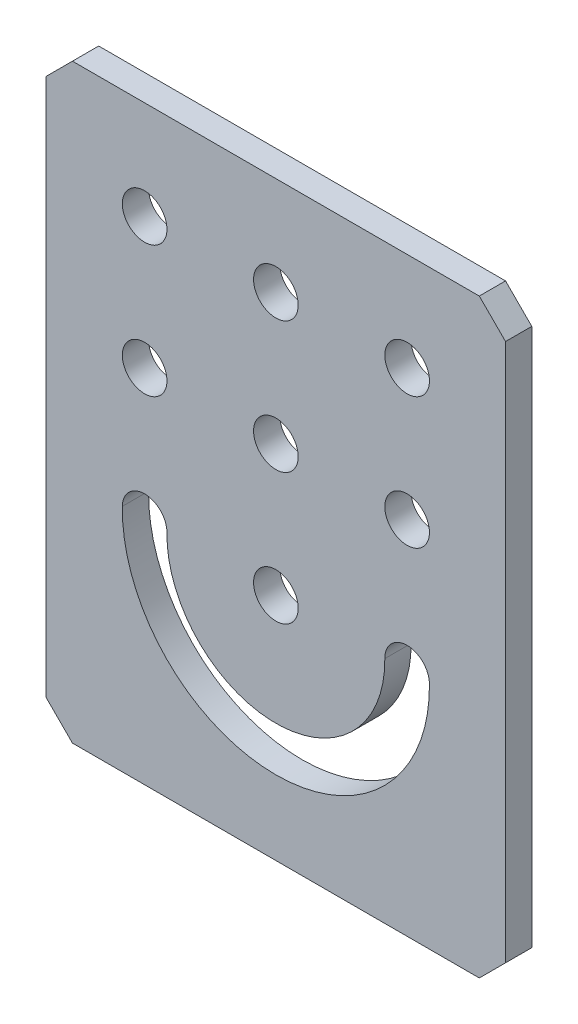
ISO-10303-21;
HEADER;
FILE_DESCRIPTION(('STEP AP214'),'2;1');
FILE_NAME('part.step','',(''),(''),'','','');
FILE_SCHEMA(('AUTOMOTIVE_DESIGN { 1 0 10303 214 1 1 1 1 }'));
ENDSEC;
DATA;
#1=APPLICATION_CONTEXT('core data for automotive mechanical design processes');
#2=APPLICATION_PROTOCOL_DEFINITION('international standard','automotive_design',2000,#1);
#3=PRODUCT_CONTEXT('',#1,'mechanical');
#4=PRODUCT('Part','Part','',(#3));
#5=PRODUCT_RELATED_PRODUCT_CATEGORY('part','',(#4));
#6=PRODUCT_DEFINITION_FORMATION('','',#4);
#7=PRODUCT_DEFINITION_CONTEXT('part definition',#1,'design');
#8=PRODUCT_DEFINITION('design','',#6,#7);
#9=PRODUCT_DEFINITION_SHAPE('','',#8);
#10=(LENGTH_UNIT() NAMED_UNIT(*) SI_UNIT(.MILLI.,.METRE.));
#11=(NAMED_UNIT(*) PLANE_ANGLE_UNIT() SI_UNIT($,.RADIAN.));
#12=(NAMED_UNIT(*) SI_UNIT($,.STERADIAN.) SOLID_ANGLE_UNIT());
#13=UNCERTAINTY_MEASURE_WITH_UNIT(LENGTH_MEASURE(1.E-05),#10,'distance_accuracy_value','');
#14=(GEOMETRIC_REPRESENTATION_CONTEXT(3) GLOBAL_UNCERTAINTY_ASSIGNED_CONTEXT((#13)) GLOBAL_UNIT_ASSIGNED_CONTEXT((#10,
#11,#12)) REPRESENTATION_CONTEXT('',''));
#15=CARTESIAN_POINT('',(0.,0.,0.));
#16=DIRECTION('',(0.,0.,1.));
#17=DIRECTION('',(1.,0.,0.));
#18=AXIS2_PLACEMENT_3D('',#15,#16,#17);
#19=CARTESIAN_POINT('',(0.,0.,2.));
#20=DIRECTION('',(0.,0.,1.));
#21=DIRECTION('',(1.,0.,0.));
#22=AXIS2_PLACEMENT_3D('',#19,#20,#21);
#23=PLANE('',#22);
#24=CARTESIAN_POINT('',(0.,-5.,2.));
#25=DIRECTION('',(0.,0.,1.));
#26=DIRECTION('',(1.,0.,0.));
#27=AXIS2_PLACEMENT_3D('',#24,#25,#26);
#28=CIRCLE('',#27,1.7);
#29=CARTESIAN_POINT('',(1.7,-5.,2.));
#30=VERTEX_POINT('',#29);
#31=EDGE_CURVE('E92',#30,#30,#28,.F.);
#32=ORIENTED_EDGE('',*,*,#31,.T.);
#33=EDGE_LOOP('',(#32));
#34=FACE_BOUND('',#33,.T.);
#35=CARTESIAN_POINT('',(9.99999999999999,5.,2.));
#36=DIRECTION('',(0.,0.,1.));
#37=DIRECTION('',(1.,0.,0.));
#38=AXIS2_PLACEMENT_3D('',#35,#36,#37);
#39=CIRCLE('',#38,1.7);
#40=CARTESIAN_POINT('',(11.7,5.,2.));
#41=VERTEX_POINT('',#40);
#42=EDGE_CURVE('E179',#41,#41,#39,.F.);
#43=ORIENTED_EDGE('',*,*,#42,.T.);
#44=EDGE_LOOP('',(#43));
#45=FACE_BOUND('',#44,.T.);
#46=CARTESIAN_POINT('',(0.,5.,2.));
#47=DIRECTION('',(0.,0.,1.));
#48=DIRECTION('',(1.,0.,0.));
#49=AXIS2_PLACEMENT_3D('',#46,#47,#48);
#50=CIRCLE('',#49,1.7);
#51=CARTESIAN_POINT('',(1.69999999999999,5.,2.));
#52=VERTEX_POINT('',#51);
#53=EDGE_CURVE('E182',#52,#52,#50,.F.);
#54=ORIENTED_EDGE('',*,*,#53,.T.);
#55=EDGE_LOOP('',(#54));
#56=FACE_BOUND('',#55,.T.);
#57=CARTESIAN_POINT('',(-10.,5.,2.));
#58=DIRECTION('',(0.,0.,1.));
#59=DIRECTION('',(1.,0.,0.));
#60=AXIS2_PLACEMENT_3D('',#57,#58,#59);
#61=CIRCLE('',#60,1.7);
#62=CARTESIAN_POINT('',(-8.30000000000001,5.,2.));
#63=VERTEX_POINT('',#62);
#64=EDGE_CURVE('E185',#63,#63,#61,.F.);
#65=ORIENTED_EDGE('',*,*,#64,.T.);
#66=EDGE_LOOP('',(#65));
#67=FACE_BOUND('',#66,.T.);
#68=CARTESIAN_POINT('',(9.99999999999999,15.,2.));
#69=DIRECTION('',(0.,0.,1.));
#70=DIRECTION('',(1.,0.,0.));
#71=AXIS2_PLACEMENT_3D('',#68,#69,#70);
#72=CIRCLE('',#71,1.7);
#73=CARTESIAN_POINT('',(11.7,15.,2.));
#74=VERTEX_POINT('',#73);
#75=EDGE_CURVE('E105',#74,#74,#72,.F.);
#76=ORIENTED_EDGE('',*,*,#75,.T.);
#77=EDGE_LOOP('',(#76));
#78=FACE_BOUND('',#77,.T.);
#79=DIRECTION('',(1.,0.,0.));
#80=VECTOR('',#79,1.);
#81=CARTESIAN_POINT('',(-17.5,22.5,2.));
#82=LINE('',#81,#80);
#83=CARTESIAN_POINT('',(15.5,22.5,2.));
#84=VERTEX_POINT('',#83);
#85=CARTESIAN_POINT('',(-15.5,22.5,2.));
#86=VERTEX_POINT('',#85);
#87=EDGE_CURVE('E130',#84,#86,#82,.F.);
#88=ORIENTED_EDGE('',*,*,#87,.T.);
#89=DIRECTION('',(0.707106781186549,0.707106781186546,0.));
#90=VECTOR('',#89,1.);
#91=CARTESIAN_POINT('',(-17.5,20.5,2.));
#92=LINE('',#91,#90);
#93=CARTESIAN_POINT('',(-17.5,20.5,2.));
#94=VERTEX_POINT('',#93);
#95=EDGE_CURVE('E124',#86,#94,#92,.F.);
#96=ORIENTED_EDGE('',*,*,#95,.T.);
#97=DIRECTION('',(0.,1.,0.));
#98=VECTOR('',#97,1.);
#99=CARTESIAN_POINT('',(-17.5,22.5,2.));
#100=LINE('',#99,#98);
#101=CARTESIAN_POINT('',(-17.5,-20.5,2.));
#102=VERTEX_POINT('',#101);
#103=EDGE_CURVE('E118',#94,#102,#100,.F.);
#104=ORIENTED_EDGE('',*,*,#103,.T.);
#105=DIRECTION('',(-0.707106781186546,0.707106781186549,0.));
#106=VECTOR('',#105,1.);
#107=CARTESIAN_POINT('',(-15.5,-22.5,2.));
#108=LINE('',#107,#106);
#109=CARTESIAN_POINT('',(-15.5,-22.5,2.));
#110=VERTEX_POINT('',#109);
#111=EDGE_CURVE('E112',#102,#110,#108,.F.);
#112=ORIENTED_EDGE('',*,*,#111,.T.);
#113=DIRECTION('',(1.,0.,0.));
#114=VECTOR('',#113,1.);
#115=CARTESIAN_POINT('',(-17.5,-22.5,2.));
#116=LINE('',#115,#114);
#117=CARTESIAN_POINT('',(15.5,-22.5,2.));
#118=VERTEX_POINT('',#117);
#119=EDGE_CURVE('E102',#110,#118,#116,.T.);
#120=ORIENTED_EDGE('',*,*,#119,.T.);
#121=DIRECTION('',(-0.707106781186549,-0.707106781186546,0.));
#122=VECTOR('',#121,1.);
#123=CARTESIAN_POINT('',(17.5,-20.5,2.));
#124=LINE('',#123,#122);
#125=CARTESIAN_POINT('',(17.5,-20.5,2.));
#126=VERTEX_POINT('',#125);
#127=EDGE_CURVE('E148',#118,#126,#124,.F.);
#128=ORIENTED_EDGE('',*,*,#127,.T.);
#129=DIRECTION('',(0.,-1.,0.));
#130=VECTOR('',#129,1.);
#131=CARTESIAN_POINT('',(17.5,22.5,2.));
#132=LINE('',#131,#130);
#133=CARTESIAN_POINT('',(17.5,20.5,2.));
#134=VERTEX_POINT('',#133);
#135=EDGE_CURVE('E142',#126,#134,#132,.F.);
#136=ORIENTED_EDGE('',*,*,#135,.T.);
#137=DIRECTION('',(0.707106781186546,-0.707106781186549,0.));
#138=VECTOR('',#137,1.);
#139=CARTESIAN_POINT('',(15.5,22.5,2.));
#140=LINE('',#139,#138);
#141=EDGE_CURVE('E136',#134,#84,#140,.F.);
#142=ORIENTED_EDGE('',*,*,#141,.T.);
#143=EDGE_LOOP('',(#88,#96,#104,#112,#120,#128,#136,#142));
#144=FACE_BOUND('',#143,.T.);
#145=CARTESIAN_POINT('',(-10.,15.,2.));
#146=DIRECTION('',(0.,0.,1.));
#147=DIRECTION('',(1.,0.,0.));
#148=AXIS2_PLACEMENT_3D('',#145,#146,#147);
#149=CIRCLE('',#148,1.7);
#150=CARTESIAN_POINT('',(-8.30000000000001,15.,2.));
#151=VERTEX_POINT('',#150);
#152=EDGE_CURVE('E150',#151,#151,#149,.F.);
#153=ORIENTED_EDGE('',*,*,#152,.T.);
#154=EDGE_LOOP('',(#153));
#155=FACE_BOUND('',#154,.T.);
#156=CARTESIAN_POINT('',(0.,15.,2.));
#157=DIRECTION('',(0.,0.,1.));
#158=DIRECTION('',(1.,0.,0.));
#159=AXIS2_PLACEMENT_3D('',#156,#157,#158);
#160=CIRCLE('',#159,1.7);
#161=CARTESIAN_POINT('',(1.69999999999999,15.,2.));
#162=VERTEX_POINT('',#161);
#163=EDGE_CURVE('E20',#162,#162,#160,.F.);
#164=ORIENTED_EDGE('',*,*,#163,.T.);
#165=EDGE_LOOP('',(#164));
#166=FACE_BOUND('',#165,.T.);
#167=CARTESIAN_POINT('',(-10.,-5.,2.));
#168=DIRECTION('',(0.,0.,1.));
#169=DIRECTION('',(1.,0.,0.));
#170=AXIS2_PLACEMENT_3D('',#167,#168,#169);
#171=CIRCLE('',#170,1.7);
#172=CARTESIAN_POINT('',(-11.6998241282363,-4.9755473300891,2.));
#173=VERTEX_POINT('',#172);
#174=CARTESIAN_POINT('',(-8.30017587176372,-5.02445266991091,2.));
#175=VERTEX_POINT('',#174);
#176=EDGE_CURVE('E59',#173,#175,#171,.F.);
#177=ORIENTED_EDGE('',*,*,#176,.T.);
#178=CARTESIAN_POINT('',(0.,-5.14385411705079,2.));
#179=DIRECTION('',(0.,0.,1.));
#180=DIRECTION('',(1.,0.,0.));
#181=AXIS2_PLACEMENT_3D('',#178,#179,#180);
#182=CIRCLE('',#181,8.30103464682492);
#183=CARTESIAN_POINT('',(8.30017587176371,-5.02445266991091,2.));
#184=VERTEX_POINT('',#183);
#185=EDGE_CURVE('E80',#184,#175,#182,.F.);
#186=ORIENTED_EDGE('',*,*,#185,.F.);
#187=CARTESIAN_POINT('',(9.99999999999999,-5.,2.));
#188=DIRECTION('',(0.,0.,1.));
#189=DIRECTION('',(1.,0.,0.));
#190=AXIS2_PLACEMENT_3D('',#187,#188,#189);
#191=CIRCLE('',#190,1.7);
#192=CARTESIAN_POINT('',(11.6998241282363,-4.9755473300891,2.));
#193=VERTEX_POINT('',#192);
#194=EDGE_CURVE('E82',#184,#193,#191,.F.);
#195=ORIENTED_EDGE('',*,*,#194,.T.);
#196=CARTESIAN_POINT('',(0.,-5.14385411705079,2.));
#197=DIRECTION('',(0.,0.,1.));
#198=DIRECTION('',(1.,0.,0.));
#199=AXIS2_PLACEMENT_3D('',#196,#197,#198);
#200=CIRCLE('',#199,11.7010346468249);
#201=EDGE_CURVE('E74',#193,#173,#200,.F.);
#202=ORIENTED_EDGE('',*,*,#201,.T.);
#203=EDGE_LOOP('',(#177,#186,#195,#202));
#204=FACE_BOUND('',#203,.T.);
#205=ADVANCED_FACE('F17',(#34,#45,#56,#67,#78,#144,#155,#166,#204),#23,.T.);
#206=CARTESIAN_POINT('',(0.,15.,0.));
#207=DIRECTION('',(0.,0.,1.));
#208=DIRECTION('',(1.,0.,0.));
#209=AXIS2_PLACEMENT_3D('',#206,#207,#208);
#210=CYLINDRICAL_SURFACE('',#209,1.7);
#211=CARTESIAN_POINT('',(0.,15.,0.));
#212=DIRECTION('',(0.,0.,1.));
#213=DIRECTION('',(1.,0.,0.));
#214=AXIS2_PLACEMENT_3D('',#211,#212,#213);
#215=CIRCLE('',#214,1.7);
#216=CARTESIAN_POINT('',(1.69999999999999,15.,0.));
#217=VERTEX_POINT('',#216);
#218=EDGE_CURVE('E95',#217,#217,#215,.F.);
#219=ORIENTED_EDGE('',*,*,#218,.T.);
#220=EDGE_LOOP('',(#219));
#221=FACE_BOUND('',#220,.T.);
#222=ORIENTED_EDGE('',*,*,#163,.F.);
#223=EDGE_LOOP('',(#222));
#224=FACE_BOUND('',#223,.T.);
#225=ADVANCED_FACE('F196',(#221,#224),#210,.F.);
#226=CARTESIAN_POINT('',(-10.,15.,0.));
#227=DIRECTION('',(0.,0.,1.));
#228=DIRECTION('',(1.,0.,0.));
#229=AXIS2_PLACEMENT_3D('',#226,#227,#228);
#230=CYLINDRICAL_SURFACE('',#229,1.7);
#231=CARTESIAN_POINT('',(-10.,15.,0.));
#232=DIRECTION('',(0.,0.,1.));
#233=DIRECTION('',(1.,0.,0.));
#234=AXIS2_PLACEMENT_3D('',#231,#232,#233);
#235=CIRCLE('',#234,1.7);
#236=CARTESIAN_POINT('',(-8.30000000000001,15.,0.));
#237=VERTEX_POINT('',#236);
#238=EDGE_CURVE('E171',#237,#237,#235,.F.);
#239=ORIENTED_EDGE('',*,*,#238,.T.);
#240=EDGE_LOOP('',(#239));
#241=FACE_BOUND('',#240,.T.);
#242=ORIENTED_EDGE('',*,*,#152,.F.);
#243=EDGE_LOOP('',(#242));
#244=FACE_BOUND('',#243,.T.);
#245=ADVANCED_FACE('F198',(#241,#244),#230,.F.);
#246=CARTESIAN_POINT('',(17.5,-20.5,2.));
#247=DIRECTION('',(-0.707106781186546,0.707106781186549,0.));
#248=DIRECTION('',(-0.707106781186549,-0.707106781186546,0.));
#249=AXIS2_PLACEMENT_3D('',#246,#247,#248);
#250=PLANE('',#249);
#251=DIRECTION('',(0.,0.,1.));
#252=VECTOR('',#251,1.);
#253=CARTESIAN_POINT('',(15.5,-22.5,2.));
#254=LINE('',#253,#252);
#255=CARTESIAN_POINT('',(15.5,-22.5,0.));
#256=VERTEX_POINT('',#255);
#257=EDGE_CURVE('E109',#118,#256,#254,.F.);
#258=ORIENTED_EDGE('',*,*,#257,.T.);
#259=DIRECTION('',(0.707106781186548,0.707106781186548,0.));
#260=VECTOR('',#259,1.);
#261=CARTESIAN_POINT('',(15.5,-22.5,0.));
#262=LINE('',#261,#260);
#263=CARTESIAN_POINT('',(17.5,-20.5,0.));
#264=VERTEX_POINT('',#263);
#265=EDGE_CURVE('E174',#256,#264,#262,.T.);
#266=ORIENTED_EDGE('',*,*,#265,.T.);
#267=DIRECTION('',(0.,0.,1.));
#268=VECTOR('',#267,1.);
#269=CARTESIAN_POINT('',(17.5,-20.5,2.));
#270=LINE('',#269,#268);
#271=EDGE_CURVE('E145',#264,#126,#270,.T.);
#272=ORIENTED_EDGE('',*,*,#271,.T.);
#273=ORIENTED_EDGE('',*,*,#127,.F.);
#274=EDGE_LOOP('',(#258,#266,#272,#273));
#275=FACE_BOUND('',#274,.T.);
#276=ADVANCED_FACE('F205',(#275),#250,.F.);
#277=CARTESIAN_POINT('',(17.5,22.5,2.));
#278=DIRECTION('',(-1.,0.,0.));
#279=DIRECTION('',(0.,-1.,0.));
#280=AXIS2_PLACEMENT_3D('',#277,#278,#279);
#281=PLANE('',#280);
#282=ORIENTED_EDGE('',*,*,#271,.F.);
#283=DIRECTION('',(0.,1.,0.));
#284=VECTOR('',#283,1.);
#285=CARTESIAN_POINT('',(17.5,0.,0.));
#286=LINE('',#285,#284);
#287=CARTESIAN_POINT('',(17.5,20.5,0.));
#288=VERTEX_POINT('',#287);
#289=EDGE_CURVE('E307',#264,#288,#286,.T.);
#290=ORIENTED_EDGE('',*,*,#289,.T.);
#291=DIRECTION('',(0.,0.,1.));
#292=VECTOR('',#291,1.);
#293=CARTESIAN_POINT('',(17.5,20.5,2.));
#294=LINE('',#293,#292);
#295=EDGE_CURVE('E139',#288,#134,#294,.T.);
#296=ORIENTED_EDGE('',*,*,#295,.T.);
#297=ORIENTED_EDGE('',*,*,#135,.F.);
#298=EDGE_LOOP('',(#282,#290,#296,#297));
#299=FACE_BOUND('',#298,.T.);
#300=ADVANCED_FACE('F271',(#299),#281,.F.);
#301=CARTESIAN_POINT('',(15.5,22.5,2.));
#302=DIRECTION('',(-0.707106781186549,-0.707106781186546,0.));
#303=DIRECTION('',(0.707106781186546,-0.707106781186549,0.));
#304=AXIS2_PLACEMENT_3D('',#301,#302,#303);
#305=PLANE('',#304);
#306=ORIENTED_EDGE('',*,*,#295,.F.);
#307=DIRECTION('',(-0.707106781186547,0.707106781186548,0.));
#308=VECTOR('',#307,1.);
#309=CARTESIAN_POINT('',(17.5,20.5,0.));
#310=LINE('',#309,#308);
#311=CARTESIAN_POINT('',(15.5,22.5,0.));
#312=VERTEX_POINT('',#311);
#313=EDGE_CURVE('E304',#288,#312,#310,.T.);
#314=ORIENTED_EDGE('',*,*,#313,.T.);
#315=DIRECTION('',(0.,0.,-1.));
#316=VECTOR('',#315,1.);
#317=CARTESIAN_POINT('',(15.5,22.5,2.));
#318=LINE('',#317,#316);
#319=EDGE_CURVE('E133',#312,#84,#318,.F.);
#320=ORIENTED_EDGE('',*,*,#319,.T.);
#321=ORIENTED_EDGE('',*,*,#141,.F.);
#322=EDGE_LOOP('',(#306,#314,#320,#321));
#323=FACE_BOUND('',#322,.T.);
#324=ADVANCED_FACE('F267',(#323),#305,.F.);
#325=CARTESIAN_POINT('',(-17.5,22.5,2.));
#326=DIRECTION('',(0.,-1.,0.));
#327=DIRECTION('',(0.,0.,-1.));
#328=AXIS2_PLACEMENT_3D('',#325,#326,#327);
#329=PLANE('',#328);
#330=DIRECTION('',(0.,0.,1.));
#331=VECTOR('',#330,1.);
#332=CARTESIAN_POINT('',(-15.5,22.5,2.));
#333=LINE('',#332,#331);
#334=CARTESIAN_POINT('',(-15.5,22.5,0.));
#335=VERTEX_POINT('',#334);
#336=EDGE_CURVE('E127',#335,#86,#333,.T.);
#337=ORIENTED_EDGE('',*,*,#336,.T.);
#338=ORIENTED_EDGE('',*,*,#87,.F.);
#339=ORIENTED_EDGE('',*,*,#319,.F.);
#340=DIRECTION('',(1.,0.,0.));
#341=VECTOR('',#340,1.);
#342=CARTESIAN_POINT('',(0.,22.5,0.));
#343=LINE('',#342,#341);
#344=EDGE_CURVE('E301',#312,#335,#343,.F.);
#345=ORIENTED_EDGE('',*,*,#344,.T.);
#346=EDGE_LOOP('',(#337,#338,#339,#345));
#347=FACE_BOUND('',#346,.T.);
#348=ADVANCED_FACE('F263',(#347),#329,.F.);
#349=CARTESIAN_POINT('',(-17.5,20.5,2.));
#350=DIRECTION('',(0.707106781186546,-0.707106781186549,0.));
#351=DIRECTION('',(0.707106781186549,0.707106781186546,0.));
#352=AXIS2_PLACEMENT_3D('',#349,#350,#351);
#353=PLANE('',#352);
#354=ORIENTED_EDGE('',*,*,#336,.F.);
#355=DIRECTION('',(-0.707106781186549,-0.707106781186546,0.));
#356=VECTOR('',#355,1.);
#357=CARTESIAN_POINT('',(-15.5,22.5,0.));
#358=LINE('',#357,#356);
#359=CARTESIAN_POINT('',(-17.5,20.5,0.));
#360=VERTEX_POINT('',#359);
#361=EDGE_CURVE('E298',#335,#360,#358,.T.);
#362=ORIENTED_EDGE('',*,*,#361,.T.);
#363=DIRECTION('',(0.,0.,1.));
#364=VECTOR('',#363,1.);
#365=CARTESIAN_POINT('',(-17.5,20.5,2.));
#366=LINE('',#365,#364);
#367=EDGE_CURVE('E121',#360,#94,#366,.T.);
#368=ORIENTED_EDGE('',*,*,#367,.T.);
#369=ORIENTED_EDGE('',*,*,#95,.F.);
#370=EDGE_LOOP('',(#354,#362,#368,#369));
#371=FACE_BOUND('',#370,.T.);
#372=ADVANCED_FACE('F259',(#371),#353,.F.);
#373=CARTESIAN_POINT('',(-17.5,22.5,2.));
#374=DIRECTION('',(1.,0.,0.));
#375=DIRECTION('',(0.,1.,0.));
#376=AXIS2_PLACEMENT_3D('',#373,#374,#375);
#377=PLANE('',#376);
#378=DIRECTION('',(0.,0.,1.));
#379=VECTOR('',#378,1.);
#380=CARTESIAN_POINT('',(-17.5,-20.5,2.));
#381=LINE('',#380,#379);
#382=CARTESIAN_POINT('',(-17.5,-20.5,0.));
#383=VERTEX_POINT('',#382);
#384=EDGE_CURVE('E115',#383,#102,#381,.T.);
#385=ORIENTED_EDGE('',*,*,#384,.T.);
#386=ORIENTED_EDGE('',*,*,#103,.F.);
#387=ORIENTED_EDGE('',*,*,#367,.F.);
#388=DIRECTION('',(0.,1.,0.));
#389=VECTOR('',#388,1.);
#390=CARTESIAN_POINT('',(-17.5,0.,0.));
#391=LINE('',#390,#389);
#392=EDGE_CURVE('E293',#360,#383,#391,.F.);
#393=ORIENTED_EDGE('',*,*,#392,.T.);
#394=EDGE_LOOP('',(#385,#386,#387,#393));
#395=FACE_BOUND('',#394,.T.);
#396=ADVANCED_FACE('F255',(#395),#377,.F.);
#397=CARTESIAN_POINT('',(-15.5,-22.5,2.));
#398=DIRECTION('',(0.707106781186549,0.707106781186546,0.));
#399=DIRECTION('',(-0.707106781186546,0.707106781186549,0.));
#400=AXIS2_PLACEMENT_3D('',#397,#398,#399);
#401=PLANE('',#400);
#402=ORIENTED_EDGE('',*,*,#384,.F.);
#403=DIRECTION('',(0.707106781186544,-0.707106781186551,0.));
#404=VECTOR('',#403,1.);
#405=CARTESIAN_POINT('',(-17.5,-20.5,0.));
#406=LINE('',#405,#404);
#407=CARTESIAN_POINT('',(-15.5,-22.5,0.));
#408=VERTEX_POINT('',#407);
#409=EDGE_CURVE('E291',#383,#408,#406,.T.);
#410=ORIENTED_EDGE('',*,*,#409,.T.);
#411=DIRECTION('',(0.,0.,1.));
#412=VECTOR('',#411,1.);
#413=CARTESIAN_POINT('',(-15.5,-22.5,2.));
#414=LINE('',#413,#412);
#415=EDGE_CURVE('E106',#408,#110,#414,.T.);
#416=ORIENTED_EDGE('',*,*,#415,.T.);
#417=ORIENTED_EDGE('',*,*,#111,.F.);
#418=EDGE_LOOP('',(#402,#410,#416,#417));
#419=FACE_BOUND('',#418,.T.);
#420=ADVANCED_FACE('F251',(#419),#401,.F.);
#421=CARTESIAN_POINT('',(-17.5,-22.5,2.));
#422=DIRECTION('',(0.,1.,0.));
#423=DIRECTION('',(0.,0.,1.));
#424=AXIS2_PLACEMENT_3D('',#421,#422,#423);
#425=PLANE('',#424);
#426=ORIENTED_EDGE('',*,*,#415,.F.);
#427=DIRECTION('',(1.,0.,0.));
#428=VECTOR('',#427,1.);
#429=CARTESIAN_POINT('',(0.,-22.5,0.));
#430=LINE('',#429,#428);
#431=EDGE_CURVE('E170',#408,#256,#430,.T.);
#432=ORIENTED_EDGE('',*,*,#431,.T.);
#433=ORIENTED_EDGE('',*,*,#257,.F.);
#434=ORIENTED_EDGE('',*,*,#119,.F.);
#435=EDGE_LOOP('',(#426,#432,#433,#434));
#436=FACE_BOUND('',#435,.T.);
#437=ADVANCED_FACE('F247',(#436),#425,.F.);
#438=CARTESIAN_POINT('',(9.99999999999999,15.,0.));
#439=DIRECTION('',(0.,0.,1.));
#440=DIRECTION('',(1.,0.,0.));
#441=AXIS2_PLACEMENT_3D('',#438,#439,#440);
#442=CYLINDRICAL_SURFACE('',#441,1.7);
#443=CARTESIAN_POINT('',(9.99999999999999,15.,0.));
#444=DIRECTION('',(0.,0.,1.));
#445=DIRECTION('',(1.,0.,0.));
#446=AXIS2_PLACEMENT_3D('',#443,#444,#445);
#447=CIRCLE('',#446,1.7);
#448=CARTESIAN_POINT('',(11.7,15.,0.));
#449=VERTEX_POINT('',#448);
#450=EDGE_CURVE('E167',#449,#449,#447,.F.);
#451=ORIENTED_EDGE('',*,*,#450,.T.);
#452=EDGE_LOOP('',(#451));
#453=FACE_BOUND('',#452,.T.);
#454=ORIENTED_EDGE('',*,*,#75,.F.);
#455=EDGE_LOOP('',(#454));
#456=FACE_BOUND('',#455,.T.);
#457=ADVANCED_FACE('F243',(#453,#456),#442,.F.);
#458=CARTESIAN_POINT('',(-10.,5.,0.));
#459=DIRECTION('',(0.,0.,1.));
#460=DIRECTION('',(1.,0.,0.));
#461=AXIS2_PLACEMENT_3D('',#458,#459,#460);
#462=CYLINDRICAL_SURFACE('',#461,1.7);
#463=CARTESIAN_POINT('',(-10.,5.,0.));
#464=DIRECTION('',(0.,0.,1.));
#465=DIRECTION('',(1.,0.,0.));
#466=AXIS2_PLACEMENT_3D('',#463,#464,#465);
#467=CIRCLE('',#466,1.7);
#468=CARTESIAN_POINT('',(-8.30000000000001,5.,0.));
#469=VERTEX_POINT('',#468);
#470=EDGE_CURVE('E164',#469,#469,#467,.F.);
#471=ORIENTED_EDGE('',*,*,#470,.T.);
#472=EDGE_LOOP('',(#471));
#473=FACE_BOUND('',#472,.T.);
#474=ORIENTED_EDGE('',*,*,#64,.F.);
#475=EDGE_LOOP('',(#474));
#476=FACE_BOUND('',#475,.T.);
#477=ADVANCED_FACE('F239',(#473,#476),#462,.F.);
#478=CARTESIAN_POINT('',(0.,5.,0.));
#479=DIRECTION('',(0.,0.,1.));
#480=DIRECTION('',(1.,0.,0.));
#481=AXIS2_PLACEMENT_3D('',#478,#479,#480);
#482=CYLINDRICAL_SURFACE('',#481,1.7);
#483=CARTESIAN_POINT('',(0.,5.,0.));
#484=DIRECTION('',(0.,0.,1.));
#485=DIRECTION('',(1.,0.,0.));
#486=AXIS2_PLACEMENT_3D('',#483,#484,#485);
#487=CIRCLE('',#486,1.7);
#488=CARTESIAN_POINT('',(1.69999999999999,5.,0.));
#489=VERTEX_POINT('',#488);
#490=EDGE_CURVE('E161',#489,#489,#487,.F.);
#491=ORIENTED_EDGE('',*,*,#490,.T.);
#492=EDGE_LOOP('',(#491));
#493=FACE_BOUND('',#492,.T.);
#494=ORIENTED_EDGE('',*,*,#53,.F.);
#495=EDGE_LOOP('',(#494));
#496=FACE_BOUND('',#495,.T.);
#497=ADVANCED_FACE('F235',(#493,#496),#482,.F.);
#498=CARTESIAN_POINT('',(9.99999999999999,5.,0.));
#499=DIRECTION('',(0.,0.,1.));
#500=DIRECTION('',(1.,0.,0.));
#501=AXIS2_PLACEMENT_3D('',#498,#499,#500);
#502=CYLINDRICAL_SURFACE('',#501,1.7);
#503=CARTESIAN_POINT('',(9.99999999999999,5.,0.));
#504=DIRECTION('',(0.,0.,1.));
#505=DIRECTION('',(1.,0.,0.));
#506=AXIS2_PLACEMENT_3D('',#503,#504,#505);
#507=CIRCLE('',#506,1.7);
#508=CARTESIAN_POINT('',(11.7,5.,0.));
#509=VERTEX_POINT('',#508);
#510=EDGE_CURVE('E158',#509,#509,#507,.F.);
#511=ORIENTED_EDGE('',*,*,#510,.T.);
#512=EDGE_LOOP('',(#511));
#513=FACE_BOUND('',#512,.T.);
#514=ORIENTED_EDGE('',*,*,#42,.F.);
#515=EDGE_LOOP('',(#514));
#516=FACE_BOUND('',#515,.T.);
#517=ADVANCED_FACE('F232',(#513,#516),#502,.F.);
#518=CARTESIAN_POINT('',(0.,-5.14385411705079,-8.));
#519=DIRECTION('',(0.,0.,1.));
#520=DIRECTION('',(1.,0.,0.));
#521=AXIS2_PLACEMENT_3D('',#518,#519,#520);
#522=CYLINDRICAL_SURFACE('',#521,11.7010346468249);
#523=CARTESIAN_POINT('',(0.,-5.14385411705079,0.));
#524=DIRECTION('',(0.,0.,1.));
#525=DIRECTION('',(1.,0.,0.));
#526=AXIS2_PLACEMENT_3D('',#523,#524,#525);
#527=CIRCLE('',#526,11.7010346468249);
#528=CARTESIAN_POINT('',(11.6998241282363,-4.9755473300891,0.));
#529=VERTEX_POINT('',#528);
#530=CARTESIAN_POINT('',(-11.6998241282363,-4.9755473300891,0.));
#531=VERTEX_POINT('',#530);
#532=EDGE_CURVE('E156',#529,#531,#527,.F.);
#533=ORIENTED_EDGE('',*,*,#532,.T.);
#534=DIRECTION('',(0.,0.,1.));
#535=VECTOR('',#534,1.);
#536=CARTESIAN_POINT('',(-11.6998241282363,-4.9755473300891,0.));
#537=LINE('',#536,#535);
#538=EDGE_CURVE('E100',#531,#173,#537,.T.);
#539=ORIENTED_EDGE('',*,*,#538,.T.);
#540=ORIENTED_EDGE('',*,*,#201,.F.);
#541=DIRECTION('',(0.,0.,1.));
#542=VECTOR('',#541,1.);
#543=CARTESIAN_POINT('',(11.6998241282363,-4.9755473300891,0.));
#544=LINE('',#543,#542);
#545=EDGE_CURVE('E89',#193,#529,#544,.F.);
#546=ORIENTED_EDGE('',*,*,#545,.T.);
#547=EDGE_LOOP('',(#533,#539,#540,#546));
#548=FACE_BOUND('',#547,.T.);
#549=ADVANCED_FACE('F229',(#548),#522,.F.);
#550=CARTESIAN_POINT('',(-10.,-5.,0.));
#551=DIRECTION('',(0.,0.,1.));
#552=DIRECTION('',(1.,0.,0.));
#553=AXIS2_PLACEMENT_3D('',#550,#551,#552);
#554=CYLINDRICAL_SURFACE('',#553,1.7);
#555=CARTESIAN_POINT('',(-10.,-5.,0.));
#556=DIRECTION('',(0.,0.,1.));
#557=DIRECTION('',(1.,0.,0.));
#558=AXIS2_PLACEMENT_3D('',#555,#556,#557);
#559=CIRCLE('',#558,1.7);
#560=CARTESIAN_POINT('',(-8.30017587176372,-5.02445266991091,0.));
#561=VERTEX_POINT('',#560);
#562=EDGE_CURVE('E51',#531,#561,#559,.F.);
#563=ORIENTED_EDGE('',*,*,#562,.T.);
#564=DIRECTION('',(0.,0.,1.));
#565=VECTOR('',#564,1.);
#566=CARTESIAN_POINT('',(-8.30017587176372,-5.02445266991091,-8.));
#567=LINE('',#566,#565);
#568=EDGE_CURVE('E151',#175,#561,#567,.F.);
#569=ORIENTED_EDGE('',*,*,#568,.F.);
#570=ORIENTED_EDGE('',*,*,#176,.F.);
#571=ORIENTED_EDGE('',*,*,#538,.F.);
#572=EDGE_LOOP('',(#563,#569,#570,#571));
#573=FACE_BOUND('',#572,.T.);
#574=ADVANCED_FACE('F226',(#573),#554,.F.);
#575=CARTESIAN_POINT('',(0.,-5.14385411705079,-8.));
#576=DIRECTION('',(0.,0.,1.));
#577=DIRECTION('',(1.,0.,0.));
#578=AXIS2_PLACEMENT_3D('',#575,#576,#577);
#579=CYLINDRICAL_SURFACE('',#578,8.30103464682492);
#580=CARTESIAN_POINT('',(0.,-5.14385411705079,0.));
#581=DIRECTION('',(0.,0.,1.));
#582=DIRECTION('',(1.,0.,0.));
#583=AXIS2_PLACEMENT_3D('',#580,#581,#582);
#584=CIRCLE('',#583,8.30103464682492);
#585=CARTESIAN_POINT('',(8.30017587176371,-5.02445266991091,0.));
#586=VERTEX_POINT('',#585);
#587=EDGE_CURVE('E34',#561,#586,#584,.T.);
#588=ORIENTED_EDGE('',*,*,#587,.T.);
#589=DIRECTION('',(0.,0.,1.));
#590=VECTOR('',#589,1.);
#591=CARTESIAN_POINT('',(8.30017587176371,-5.0244526699109,0.));
#592=LINE('',#591,#590);
#593=EDGE_CURVE('E87',#586,#184,#592,.T.);
#594=ORIENTED_EDGE('',*,*,#593,.T.);
#595=ORIENTED_EDGE('',*,*,#185,.T.);
#596=ORIENTED_EDGE('',*,*,#568,.T.);
#597=EDGE_LOOP('',(#588,#594,#595,#596));
#598=FACE_BOUND('',#597,.T.);
#599=ADVANCED_FACE('F91',(#598),#579,.T.);
#600=CARTESIAN_POINT('',(9.99999999999999,-5.,0.));
#601=DIRECTION('',(0.,0.,1.));
#602=DIRECTION('',(1.,0.,0.));
#603=AXIS2_PLACEMENT_3D('',#600,#601,#602);
#604=CYLINDRICAL_SURFACE('',#603,1.7);
#605=CARTESIAN_POINT('',(9.99999999999999,-5.,0.));
#606=DIRECTION('',(0.,0.,1.));
#607=DIRECTION('',(1.,0.,0.));
#608=AXIS2_PLACEMENT_3D('',#605,#606,#607);
#609=CIRCLE('',#608,1.7);
#610=EDGE_CURVE('E26',#586,#529,#609,.F.);
#611=ORIENTED_EDGE('',*,*,#610,.T.);
#612=ORIENTED_EDGE('',*,*,#545,.F.);
#613=ORIENTED_EDGE('',*,*,#194,.F.);
#614=ORIENTED_EDGE('',*,*,#593,.F.);
#615=EDGE_LOOP('',(#611,#612,#613,#614));
#616=FACE_BOUND('',#615,.T.);
#617=ADVANCED_FACE('F86',(#616),#604,.F.);
#618=CARTESIAN_POINT('',(0.,-5.,0.));
#619=DIRECTION('',(0.,0.,1.));
#620=DIRECTION('',(1.,0.,0.));
#621=AXIS2_PLACEMENT_3D('',#618,#619,#620);
#622=CYLINDRICAL_SURFACE('',#621,1.7);
#623=CARTESIAN_POINT('',(0.,-5.,0.));
#624=DIRECTION('',(0.,0.,1.));
#625=DIRECTION('',(1.,0.,0.));
#626=AXIS2_PLACEMENT_3D('',#623,#624,#625);
#627=CIRCLE('',#626,1.7);
#628=CARTESIAN_POINT('',(1.7,-5.,0.));
#629=VERTEX_POINT('',#628);
#630=EDGE_CURVE('E10',#629,#629,#627,.F.);
#631=ORIENTED_EDGE('',*,*,#630,.T.);
#632=EDGE_LOOP('',(#631));
#633=FACE_BOUND('',#632,.T.);
#634=ORIENTED_EDGE('',*,*,#31,.F.);
#635=EDGE_LOOP('',(#634));
#636=FACE_BOUND('',#635,.T.);
#637=ADVANCED_FACE('F211',(#633,#636),#622,.F.);
#638=CARTESIAN_POINT('',(0.,0.,0.));
#639=DIRECTION('',(0.,0.,1.));
#640=DIRECTION('',(1.,0.,0.));
#641=AXIS2_PLACEMENT_3D('',#638,#639,#640);
#642=PLANE('',#641);
#643=ORIENTED_EDGE('',*,*,#630,.F.);
#644=EDGE_LOOP('',(#643));
#645=FACE_BOUND('',#644,.T.);
#646=ORIENTED_EDGE('',*,*,#610,.F.);
#647=ORIENTED_EDGE('',*,*,#587,.F.);
#648=ORIENTED_EDGE('',*,*,#562,.F.);
#649=ORIENTED_EDGE('',*,*,#532,.F.);
#650=EDGE_LOOP('',(#646,#647,#648,#649));
#651=FACE_BOUND('',#650,.T.);
#652=ORIENTED_EDGE('',*,*,#510,.F.);
#653=EDGE_LOOP('',(#652));
#654=FACE_BOUND('',#653,.T.);
#655=ORIENTED_EDGE('',*,*,#490,.F.);
#656=EDGE_LOOP('',(#655));
#657=FACE_BOUND('',#656,.T.);
#658=ORIENTED_EDGE('',*,*,#470,.F.);
#659=EDGE_LOOP('',(#658));
#660=FACE_BOUND('',#659,.T.);
#661=ORIENTED_EDGE('',*,*,#450,.F.);
#662=EDGE_LOOP('',(#661));
#663=FACE_BOUND('',#662,.T.);
#664=ORIENTED_EDGE('',*,*,#409,.F.);
#665=ORIENTED_EDGE('',*,*,#392,.F.);
#666=ORIENTED_EDGE('',*,*,#361,.F.);
#667=ORIENTED_EDGE('',*,*,#344,.F.);
#668=ORIENTED_EDGE('',*,*,#313,.F.);
#669=ORIENTED_EDGE('',*,*,#289,.F.);
#670=ORIENTED_EDGE('',*,*,#265,.F.);
#671=ORIENTED_EDGE('',*,*,#431,.F.);
#672=EDGE_LOOP('',(#664,#665,#666,#667,#668,#669,#670,#671));
#673=FACE_BOUND('',#672,.T.);
#674=ORIENTED_EDGE('',*,*,#238,.F.);
#675=EDGE_LOOP('',(#674));
#676=FACE_BOUND('',#675,.T.);
#677=ORIENTED_EDGE('',*,*,#218,.F.);
#678=EDGE_LOOP('',(#677));
#679=FACE_BOUND('',#678,.T.);
#680=ADVANCED_FACE('F209',(#645,#651,#654,#657,#660,#663,#673,#676,#679),#642,.F.);
#681=CLOSED_SHELL('',(#205,#225,#245,#276,#300,#324,#348,#372,#396,#420,#437,#457,#477,#497,
#517,#549,#574,#599,#617,#637,#680));
#682=MANIFOLD_SOLID_BREP('B1',#681);
#683=ADVANCED_BREP_SHAPE_REPRESENTATION('',(#18,#682),#14);
#684=SHAPE_DEFINITION_REPRESENTATION(#9,#683);
ENDSEC;
END-ISO-10303-21;
